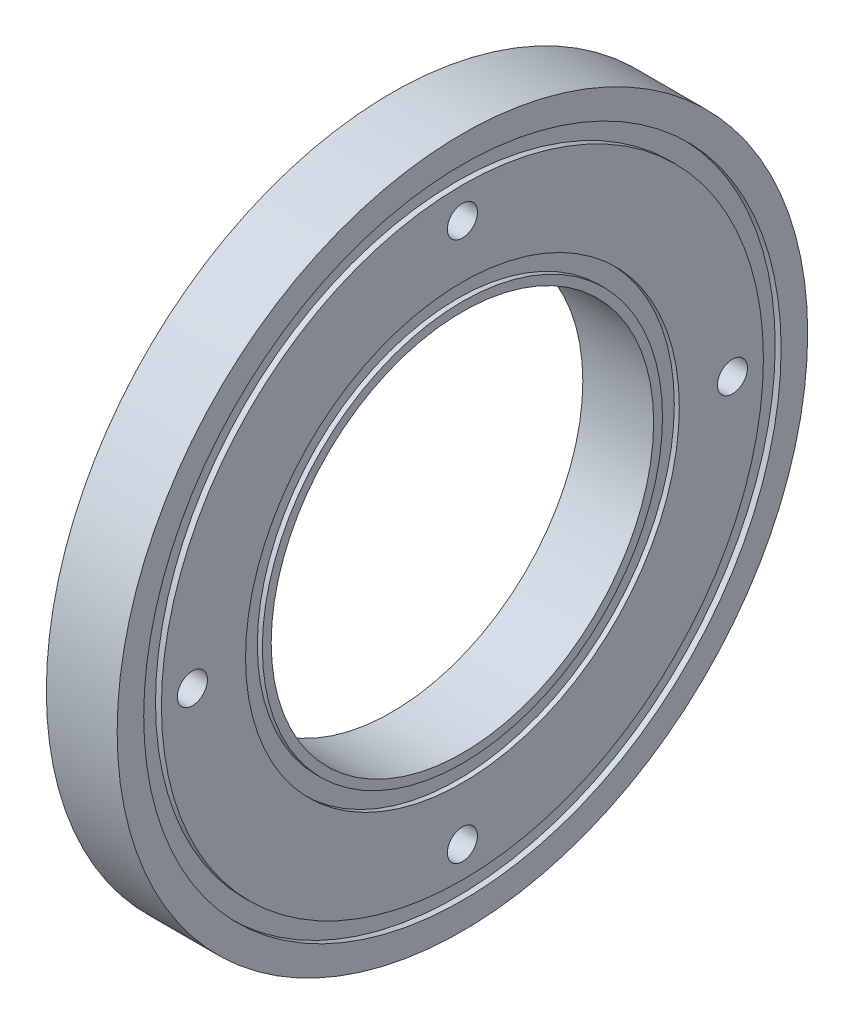
ISO-10303-21;
HEADER;
FILE_DESCRIPTION(('STEP AP214'),'2;1');
FILE_NAME('part.step','',(''),(''),'','','');
FILE_SCHEMA(('AUTOMOTIVE_DESIGN { 1 0 10303 214 1 1 1 1 }'));
ENDSEC;
DATA;
#1=APPLICATION_CONTEXT('core data for automotive mechanical design processes');
#2=APPLICATION_PROTOCOL_DEFINITION('international standard','automotive_design',2000,#1);
#3=PRODUCT_CONTEXT('',#1,'mechanical');
#4=PRODUCT('Part','Part','',(#3));
#5=PRODUCT_RELATED_PRODUCT_CATEGORY('part','',(#4));
#6=PRODUCT_DEFINITION_FORMATION('','',#4);
#7=PRODUCT_DEFINITION_CONTEXT('part definition',#1,'design');
#8=PRODUCT_DEFINITION('design','',#6,#7);
#9=PRODUCT_DEFINITION_SHAPE('','',#8);
#10=(LENGTH_UNIT() NAMED_UNIT(*) SI_UNIT(.MILLI.,.METRE.));
#11=(NAMED_UNIT(*) PLANE_ANGLE_UNIT() SI_UNIT($,.RADIAN.));
#12=(NAMED_UNIT(*) SI_UNIT($,.STERADIAN.) SOLID_ANGLE_UNIT());
#13=UNCERTAINTY_MEASURE_WITH_UNIT(LENGTH_MEASURE(1.E-05),#10,'distance_accuracy_value','');
#14=(GEOMETRIC_REPRESENTATION_CONTEXT(3) GLOBAL_UNCERTAINTY_ASSIGNED_CONTEXT((#13)) GLOBAL_UNIT_ASSIGNED_CONTEXT((#10,
#11,#12)) REPRESENTATION_CONTEXT('',''));
#15=CARTESIAN_POINT('',(0.,0.,0.));
#16=DIRECTION('',(0.,0.,1.));
#17=DIRECTION('',(1.,0.,0.));
#18=AXIS2_PLACEMENT_3D('',#15,#16,#17);
#19=CARTESIAN_POINT('',(13.7146712087275,0.,0.));
#20=DIRECTION('',(1.,0.,0.));
#21=DIRECTION('',(0.,0.,-1.));
#22=AXIS2_PLACEMENT_3D('',#19,#20,#21);
#23=PLANE('',#22);
#24=CARTESIAN_POINT('',(13.7146712087275,0.,0.));
#25=DIRECTION('',(-1.,0.,0.));
#26=DIRECTION('',(0.,0.,1.));
#27=AXIS2_PLACEMENT_3D('',#24,#25,#26);
#28=CIRCLE('',#27,34.);
#29=CARTESIAN_POINT('',(13.7146712087275,0.,34.));
#30=VERTEX_POINT('',#29);
#31=EDGE_CURVE('E10',#30,#30,#28,.T.);
#32=ORIENTED_EDGE('',*,*,#31,.F.);
#33=EDGE_LOOP('',(#32));
#34=FACE_BOUND('',#33,.T.);
#35=CARTESIAN_POINT('',(13.7146712087275,0.,0.));
#36=DIRECTION('',(-1.,0.,0.));
#37=DIRECTION('',(0.,0.,1.));
#38=AXIS2_PLACEMENT_3D('',#35,#36,#37);
#39=CIRCLE('',#38,36.);
#40=CARTESIAN_POINT('',(13.7146712087275,0.,36.));
#41=VERTEX_POINT('',#40);
#42=EDGE_CURVE('E105',#41,#41,#39,.T.);
#43=ORIENTED_EDGE('',*,*,#42,.T.);
#44=EDGE_LOOP('',(#43));
#45=FACE_BOUND('',#44,.T.);
#46=ADVANCED_FACE('F41',(#34,#45),#23,.F.);
#47=CARTESIAN_POINT('',(-801.920554309434,0.,0.));
#48=DIRECTION('',(-1.,0.,0.));
#49=DIRECTION('',(0.,0.,1.));
#50=AXIS2_PLACEMENT_3D('',#47,#48,#49);
#51=CYLINDRICAL_SURFACE('',#50,34.);
#52=CARTESIAN_POINT('',(13.0476712087275,0.,0.));
#53=DIRECTION('',(-1.,0.,0.));
#54=DIRECTION('',(0.,0.,1.));
#55=AXIS2_PLACEMENT_3D('',#52,#53,#54);
#56=CIRCLE('',#55,34.);
#57=CARTESIAN_POINT('',(13.0476712087275,0.,34.));
#58=VERTEX_POINT('',#57);
#59=EDGE_CURVE('E47',#58,#58,#56,.T.);
#60=ORIENTED_EDGE('',*,*,#59,.F.);
#61=EDGE_LOOP('',(#60));
#62=FACE_BOUND('',#61,.T.);
#63=ORIENTED_EDGE('',*,*,#31,.T.);
#64=EDGE_LOOP('',(#63));
#65=FACE_BOUND('',#64,.T.);
#66=ADVANCED_FACE('F139',(#62,#65),#51,.T.);
#67=CARTESIAN_POINT('',(13.0476712087275,0.,0.));
#68=DIRECTION('',(1.,0.,0.));
#69=DIRECTION('',(0.,0.,-1.));
#70=AXIS2_PLACEMENT_3D('',#67,#68,#69);
#71=PLANE('',#70);
#72=CARTESIAN_POINT('',(13.0476712087275,30.5,0.));
#73=DIRECTION('',(-1.,0.,0.));
#74=DIRECTION('',(0.,0.,1.));
#75=AXIS2_PLACEMENT_3D('',#72,#73,#74);
#76=CIRCLE('',#75,1.7);
#77=CARTESIAN_POINT('',(13.0476712087275,30.5,1.7));
#78=VERTEX_POINT('',#77);
#79=EDGE_CURVE('E129',#78,#78,#76,.T.);
#80=ORIENTED_EDGE('',*,*,#79,.F.);
#81=EDGE_LOOP('',(#80));
#82=FACE_BOUND('',#81,.T.);
#83=CARTESIAN_POINT('',(13.0476712087275,0.,30.5));
#84=DIRECTION('',(-1.,0.,0.));
#85=DIRECTION('',(0.,0.,1.));
#86=AXIS2_PLACEMENT_3D('',#83,#84,#85);
#87=CIRCLE('',#86,1.7);
#88=CARTESIAN_POINT('',(13.0476712087275,0.,32.2));
#89=VERTEX_POINT('',#88);
#90=EDGE_CURVE('E123',#89,#89,#87,.T.);
#91=ORIENTED_EDGE('',*,*,#90,.F.);
#92=EDGE_LOOP('',(#91));
#93=FACE_BOUND('',#92,.T.);
#94=CARTESIAN_POINT('',(13.0476712087275,0.,-30.5));
#95=DIRECTION('',(-1.,0.,0.));
#96=DIRECTION('',(0.,0.,1.));
#97=AXIS2_PLACEMENT_3D('',#94,#95,#96);
#98=CIRCLE('',#97,1.7);
#99=CARTESIAN_POINT('',(13.0476712087275,0.,-28.8));
#100=VERTEX_POINT('',#99);
#101=EDGE_CURVE('E117',#100,#100,#98,.T.);
#102=ORIENTED_EDGE('',*,*,#101,.F.);
#103=EDGE_LOOP('',(#102));
#104=FACE_BOUND('',#103,.T.);
#105=CARTESIAN_POINT('',(13.0476712087275,-30.5,0.));
#106=DIRECTION('',(-1.,0.,0.));
#107=DIRECTION('',(0.,0.,1.));
#108=AXIS2_PLACEMENT_3D('',#105,#106,#107);
#109=CIRCLE('',#108,1.7);
#110=CARTESIAN_POINT('',(13.0476712087275,-30.5,1.7));
#111=VERTEX_POINT('',#110);
#112=EDGE_CURVE('E111',#111,#111,#109,.T.);
#113=ORIENTED_EDGE('',*,*,#112,.F.);
#114=EDGE_LOOP('',(#113));
#115=FACE_BOUND('',#114,.T.);
#116=CARTESIAN_POINT('',(13.0476712087275,0.,0.));
#117=DIRECTION('',(-1.,0.,0.));
#118=DIRECTION('',(0.,0.,1.));
#119=AXIS2_PLACEMENT_3D('',#116,#117,#118);
#120=CIRCLE('',#119,24.5);
#121=CARTESIAN_POINT('',(13.0476712087275,0.,24.5));
#122=VERTEX_POINT('',#121);
#123=EDGE_CURVE('E51',#122,#122,#120,.T.);
#124=ORIENTED_EDGE('',*,*,#123,.F.);
#125=EDGE_LOOP('',(#124));
#126=FACE_BOUND('',#125,.T.);
#127=ORIENTED_EDGE('',*,*,#59,.T.);
#128=EDGE_LOOP('',(#127));
#129=FACE_BOUND('',#128,.T.);
#130=ADVANCED_FACE('F135',(#82,#93,#104,#115,#126,#129),#71,.F.);
#131=CARTESIAN_POINT('',(-801.920554309434,0.,0.));
#132=DIRECTION('',(-1.,0.,0.));
#133=DIRECTION('',(0.,0.,1.));
#134=AXIS2_PLACEMENT_3D('',#131,#132,#133);
#135=CYLINDRICAL_SURFACE('',#134,24.5);
#136=CARTESIAN_POINT('',(13.6136712087275,0.,0.));
#137=DIRECTION('',(-1.,0.,0.));
#138=DIRECTION('',(0.,0.,1.));
#139=AXIS2_PLACEMENT_3D('',#136,#137,#138);
#140=CIRCLE('',#139,24.5);
#141=CARTESIAN_POINT('',(13.6136712087275,0.,24.5));
#142=VERTEX_POINT('',#141);
#143=EDGE_CURVE('E55',#142,#142,#140,.T.);
#144=ORIENTED_EDGE('',*,*,#143,.F.);
#145=EDGE_LOOP('',(#144));
#146=FACE_BOUND('',#145,.T.);
#147=ORIENTED_EDGE('',*,*,#123,.T.);
#148=EDGE_LOOP('',(#147));
#149=FACE_BOUND('',#148,.T.);
#150=ADVANCED_FACE('F138',(#146,#149),#135,.F.);
#151=CARTESIAN_POINT('',(13.6136712087275,0.,0.));
#152=DIRECTION('',(1.,0.,0.));
#153=DIRECTION('',(0.,0.,-1.));
#154=AXIS2_PLACEMENT_3D('',#151,#152,#153);
#155=PLANE('',#154);
#156=CARTESIAN_POINT('',(13.6136712087275,0.,0.));
#157=DIRECTION('',(-1.,0.,0.));
#158=DIRECTION('',(0.,0.,1.));
#159=AXIS2_PLACEMENT_3D('',#156,#157,#158);
#160=CIRCLE('',#159,22.6);
#161=CARTESIAN_POINT('',(13.6136712087275,0.,22.6));
#162=VERTEX_POINT('',#161);
#163=EDGE_CURVE('E60',#162,#162,#160,.T.);
#164=ORIENTED_EDGE('',*,*,#163,.F.);
#165=EDGE_LOOP('',(#164));
#166=FACE_BOUND('',#165,.T.);
#167=ORIENTED_EDGE('',*,*,#143,.T.);
#168=EDGE_LOOP('',(#167));
#169=FACE_BOUND('',#168,.T.);
#170=ADVANCED_FACE('F151',(#166,#169),#155,.F.);
#171=CARTESIAN_POINT('',(-801.920554309434,0.,0.));
#172=DIRECTION('',(-1.,0.,0.));
#173=DIRECTION('',(0.,0.,1.));
#174=AXIS2_PLACEMENT_3D('',#171,#172,#173);
#175=CYLINDRICAL_SURFACE('',#174,22.6);
#176=CARTESIAN_POINT('',(13.0476712087275,0.,0.));
#177=DIRECTION('',(-1.,0.,0.));
#178=DIRECTION('',(0.,0.,1.));
#179=AXIS2_PLACEMENT_3D('',#176,#177,#178);
#180=CIRCLE('',#179,22.6);
#181=CARTESIAN_POINT('',(13.0476712087275,0.,22.6));
#182=VERTEX_POINT('',#181);
#183=EDGE_CURVE('E63',#182,#182,#180,.T.);
#184=ORIENTED_EDGE('',*,*,#183,.F.);
#185=EDGE_LOOP('',(#184));
#186=FACE_BOUND('',#185,.T.);
#187=ORIENTED_EDGE('',*,*,#163,.T.);
#188=EDGE_LOOP('',(#187));
#189=FACE_BOUND('',#188,.T.);
#190=ADVANCED_FACE('F158',(#186,#189),#175,.T.);
#191=CARTESIAN_POINT('',(13.0476712087275,0.,0.));
#192=DIRECTION('',(1.,0.,0.));
#193=DIRECTION('',(0.,0.,-1.));
#194=AXIS2_PLACEMENT_3D('',#191,#192,#193);
#195=PLANE('',#194);
#196=CARTESIAN_POINT('',(13.0476712087275,0.,0.));
#197=DIRECTION('',(-1.,0.,0.));
#198=DIRECTION('',(0.,0.,1.));
#199=AXIS2_PLACEMENT_3D('',#196,#197,#198);
#200=CIRCLE('',#199,21.6);
#201=CARTESIAN_POINT('',(13.0476712087275,0.,21.6));
#202=VERTEX_POINT('',#201);
#203=EDGE_CURVE('E66',#202,#202,#200,.T.);
#204=ORIENTED_EDGE('',*,*,#203,.F.);
#205=EDGE_LOOP('',(#204));
#206=FACE_BOUND('',#205,.T.);
#207=ORIENTED_EDGE('',*,*,#183,.T.);
#208=EDGE_LOOP('',(#207));
#209=FACE_BOUND('',#208,.T.);
#210=ADVANCED_FACE('F228',(#206,#209),#195,.F.);
#211=CARTESIAN_POINT('',(-801.920554309434,0.,0.));
#212=DIRECTION('',(-1.,0.,0.));
#213=DIRECTION('',(0.,0.,1.));
#214=AXIS2_PLACEMENT_3D('',#211,#212,#213);
#215=CYLINDRICAL_SURFACE('',#214,21.6);
#216=CARTESIAN_POINT('',(21.0476712087275,0.,0.));
#217=DIRECTION('',(-1.,0.,0.));
#218=DIRECTION('',(0.,0.,1.));
#219=AXIS2_PLACEMENT_3D('',#216,#217,#218);
#220=CIRCLE('',#219,21.6);
#221=CARTESIAN_POINT('',(21.0476712087275,0.,21.6));
#222=VERTEX_POINT('',#221);
#223=EDGE_CURVE('E69',#222,#222,#220,.T.);
#224=ORIENTED_EDGE('',*,*,#223,.F.);
#225=EDGE_LOOP('',(#224));
#226=FACE_BOUND('',#225,.T.);
#227=ORIENTED_EDGE('',*,*,#203,.T.);
#228=EDGE_LOOP('',(#227));
#229=FACE_BOUND('',#228,.T.);
#230=ADVANCED_FACE('F224',(#226,#229),#215,.F.);
#231=CARTESIAN_POINT('',(21.0476712087275,0.,0.));
#232=DIRECTION('',(1.,0.,0.));
#233=DIRECTION('',(0.,0.,-1.));
#234=AXIS2_PLACEMENT_3D('',#231,#232,#233);
#235=PLANE('',#234);
#236=ORIENTED_EDGE('',*,*,#223,.T.);
#237=EDGE_LOOP('',(#236));
#238=FACE_BOUND('',#237,.T.);
#239=CARTESIAN_POINT('',(21.0476712087275,0.,0.));
#240=DIRECTION('',(-1.,0.,0.));
#241=DIRECTION('',(0.,0.,1.));
#242=AXIS2_PLACEMENT_3D('',#239,#240,#241);
#243=CIRCLE('',#242,22.6);
#244=CARTESIAN_POINT('',(21.0476712087275,0.,22.6));
#245=VERTEX_POINT('',#244);
#246=EDGE_CURVE('E72',#245,#245,#243,.T.);
#247=ORIENTED_EDGE('',*,*,#246,.F.);
#248=EDGE_LOOP('',(#247));
#249=FACE_BOUND('',#248,.T.);
#250=ADVANCED_FACE('F220',(#238,#249),#235,.T.);
#251=CARTESIAN_POINT('',(-801.920554309434,0.,0.));
#252=DIRECTION('',(-1.,0.,0.));
#253=DIRECTION('',(0.,0.,1.));
#254=AXIS2_PLACEMENT_3D('',#251,#252,#253);
#255=CYLINDRICAL_SURFACE('',#254,22.6);
#256=ORIENTED_EDGE('',*,*,#246,.T.);
#257=EDGE_LOOP('',(#256));
#258=FACE_BOUND('',#257,.T.);
#259=CARTESIAN_POINT('',(20.4816712087276,0.,0.));
#260=DIRECTION('',(-1.,0.,0.));
#261=DIRECTION('',(0.,0.,1.));
#262=AXIS2_PLACEMENT_3D('',#259,#260,#261);
#263=CIRCLE('',#262,22.6);
#264=CARTESIAN_POINT('',(20.4816712087276,0.,22.6));
#265=VERTEX_POINT('',#264);
#266=EDGE_CURVE('E75',#265,#265,#263,.T.);
#267=ORIENTED_EDGE('',*,*,#266,.F.);
#268=EDGE_LOOP('',(#267));
#269=FACE_BOUND('',#268,.T.);
#270=ADVANCED_FACE('F216',(#258,#269),#255,.T.);
#271=CARTESIAN_POINT('',(20.4816712087275,0.,0.));
#272=DIRECTION('',(1.,0.,0.));
#273=DIRECTION('',(0.,0.,-1.));
#274=AXIS2_PLACEMENT_3D('',#271,#272,#273);
#275=PLANE('',#274);
#276=ORIENTED_EDGE('',*,*,#266,.T.);
#277=EDGE_LOOP('',(#276));
#278=FACE_BOUND('',#277,.T.);
#279=CARTESIAN_POINT('',(20.4816712087276,0.,0.));
#280=DIRECTION('',(-1.,0.,0.));
#281=DIRECTION('',(0.,0.,1.));
#282=AXIS2_PLACEMENT_3D('',#279,#280,#281);
#283=CIRCLE('',#282,24.5);
#284=CARTESIAN_POINT('',(20.4816712087276,0.,24.5));
#285=VERTEX_POINT('',#284);
#286=EDGE_CURVE('E78',#285,#285,#283,.T.);
#287=ORIENTED_EDGE('',*,*,#286,.F.);
#288=EDGE_LOOP('',(#287));
#289=FACE_BOUND('',#288,.T.);
#290=ADVANCED_FACE('F212',(#278,#289),#275,.T.);
#291=CARTESIAN_POINT('',(-801.920554309434,0.,0.));
#292=DIRECTION('',(-1.,0.,0.));
#293=DIRECTION('',(0.,0.,1.));
#294=AXIS2_PLACEMENT_3D('',#291,#292,#293);
#295=CYLINDRICAL_SURFACE('',#294,24.5);
#296=ORIENTED_EDGE('',*,*,#286,.T.);
#297=EDGE_LOOP('',(#296));
#298=FACE_BOUND('',#297,.T.);
#299=CARTESIAN_POINT('',(21.0476712087275,0.,0.));
#300=DIRECTION('',(-1.,0.,0.));
#301=DIRECTION('',(0.,0.,1.));
#302=AXIS2_PLACEMENT_3D('',#299,#300,#301);
#303=CIRCLE('',#302,24.5);
#304=CARTESIAN_POINT('',(21.0476712087275,0.,24.5));
#305=VERTEX_POINT('',#304);
#306=EDGE_CURVE('E81',#305,#305,#303,.T.);
#307=ORIENTED_EDGE('',*,*,#306,.F.);
#308=EDGE_LOOP('',(#307));
#309=FACE_BOUND('',#308,.T.);
#310=ADVANCED_FACE('F209',(#298,#309),#295,.F.);
#311=CARTESIAN_POINT('',(21.0476712087275,0.,0.));
#312=DIRECTION('',(-1.,0.,0.));
#313=DIRECTION('',(0.,0.,1.));
#314=AXIS2_PLACEMENT_3D('',#311,#312,#313);
#315=PLANE('',#314);
#316=CARTESIAN_POINT('',(21.0476712087275,30.5,0.));
#317=DIRECTION('',(-1.,0.,0.));
#318=DIRECTION('',(0.,0.,1.));
#319=AXIS2_PLACEMENT_3D('',#316,#317,#318);
#320=CIRCLE('',#319,1.7);
#321=CARTESIAN_POINT('',(21.0476712087275,30.5,1.7));
#322=VERTEX_POINT('',#321);
#323=EDGE_CURVE('E126',#322,#322,#320,.T.);
#324=ORIENTED_EDGE('',*,*,#323,.T.);
#325=EDGE_LOOP('',(#324));
#326=FACE_BOUND('',#325,.T.);
#327=CARTESIAN_POINT('',(21.0476712087275,0.,30.5));
#328=DIRECTION('',(-1.,0.,0.));
#329=DIRECTION('',(0.,0.,1.));
#330=AXIS2_PLACEMENT_3D('',#327,#328,#329);
#331=CIRCLE('',#330,1.7);
#332=CARTESIAN_POINT('',(21.0476712087275,0.,32.2));
#333=VERTEX_POINT('',#332);
#334=EDGE_CURVE('E120',#333,#333,#331,.T.);
#335=ORIENTED_EDGE('',*,*,#334,.T.);
#336=EDGE_LOOP('',(#335));
#337=FACE_BOUND('',#336,.T.);
#338=CARTESIAN_POINT('',(21.0476712087275,0.,-30.5));
#339=DIRECTION('',(-1.,0.,0.));
#340=DIRECTION('',(0.,0.,1.));
#341=AXIS2_PLACEMENT_3D('',#338,#339,#340);
#342=CIRCLE('',#341,1.7);
#343=CARTESIAN_POINT('',(21.0476712087275,0.,-28.8));
#344=VERTEX_POINT('',#343);
#345=EDGE_CURVE('E114',#344,#344,#342,.T.);
#346=ORIENTED_EDGE('',*,*,#345,.T.);
#347=EDGE_LOOP('',(#346));
#348=FACE_BOUND('',#347,.T.);
#349=CARTESIAN_POINT('',(21.0476712087275,-30.5,0.));
#350=DIRECTION('',(-1.,0.,0.));
#351=DIRECTION('',(0.,0.,1.));
#352=AXIS2_PLACEMENT_3D('',#349,#350,#351);
#353=CIRCLE('',#352,1.7);
#354=CARTESIAN_POINT('',(21.0476712087275,-30.5,1.7));
#355=VERTEX_POINT('',#354);
#356=EDGE_CURVE('E108',#355,#355,#353,.T.);
#357=ORIENTED_EDGE('',*,*,#356,.T.);
#358=EDGE_LOOP('',(#357));
#359=FACE_BOUND('',#358,.T.);
#360=CARTESIAN_POINT('',(21.0476712087275,0.,0.));
#361=DIRECTION('',(-1.,0.,0.));
#362=DIRECTION('',(0.,0.,1.));
#363=AXIS2_PLACEMENT_3D('',#360,#361,#362);
#364=CIRCLE('',#363,34.);
#365=CARTESIAN_POINT('',(21.0476712087275,0.,34.));
#366=VERTEX_POINT('',#365);
#367=EDGE_CURVE('E84',#366,#366,#364,.T.);
#368=ORIENTED_EDGE('',*,*,#367,.F.);
#369=EDGE_LOOP('',(#368));
#370=FACE_BOUND('',#369,.T.);
#371=ORIENTED_EDGE('',*,*,#306,.T.);
#372=EDGE_LOOP('',(#371));
#373=FACE_BOUND('',#372,.T.);
#374=ADVANCED_FACE('F192',(#326,#337,#348,#359,#370,#373),#315,.F.);
#375=CARTESIAN_POINT('',(-801.920554309434,0.,0.));
#376=DIRECTION('',(-1.,0.,0.));
#377=DIRECTION('',(0.,0.,1.));
#378=AXIS2_PLACEMENT_3D('',#375,#376,#377);
#379=CYLINDRICAL_SURFACE('',#378,34.);
#380=ORIENTED_EDGE('',*,*,#367,.T.);
#381=EDGE_LOOP('',(#380));
#382=FACE_BOUND('',#381,.T.);
#383=CARTESIAN_POINT('',(20.3806712087274,0.,0.));
#384=DIRECTION('',(-1.,0.,0.));
#385=DIRECTION('',(0.,0.,1.));
#386=AXIS2_PLACEMENT_3D('',#383,#384,#385);
#387=CIRCLE('',#386,34.);
#388=CARTESIAN_POINT('',(20.3806712087274,0.,34.));
#389=VERTEX_POINT('',#388);
#390=EDGE_CURVE('E87',#389,#389,#387,.T.);
#391=ORIENTED_EDGE('',*,*,#390,.F.);
#392=EDGE_LOOP('',(#391));
#393=FACE_BOUND('',#392,.T.);
#394=ADVANCED_FACE('F202',(#382,#393),#379,.T.);
#395=CARTESIAN_POINT('',(20.3806712087275,0.,0.));
#396=DIRECTION('',(1.,0.,0.));
#397=DIRECTION('',(0.,0.,-1.));
#398=AXIS2_PLACEMENT_3D('',#395,#396,#397);
#399=PLANE('',#398);
#400=ORIENTED_EDGE('',*,*,#390,.T.);
#401=EDGE_LOOP('',(#400));
#402=FACE_BOUND('',#401,.T.);
#403=CARTESIAN_POINT('',(20.3806712087274,0.,0.));
#404=DIRECTION('',(-1.,0.,0.));
#405=DIRECTION('',(0.,0.,1.));
#406=AXIS2_PLACEMENT_3D('',#403,#404,#405);
#407=CIRCLE('',#406,36.);
#408=CARTESIAN_POINT('',(20.3806712087274,0.,36.));
#409=VERTEX_POINT('',#408);
#410=EDGE_CURVE('E90',#409,#409,#407,.T.);
#411=ORIENTED_EDGE('',*,*,#410,.F.);
#412=EDGE_LOOP('',(#411));
#413=FACE_BOUND('',#412,.T.);
#414=ADVANCED_FACE('F196',(#402,#413),#399,.T.);
#415=CARTESIAN_POINT('',(-801.920554309434,0.,0.));
#416=DIRECTION('',(-1.,0.,0.));
#417=DIRECTION('',(0.,0.,1.));
#418=AXIS2_PLACEMENT_3D('',#415,#416,#417);
#419=CYLINDRICAL_SURFACE('',#418,36.);
#420=ORIENTED_EDGE('',*,*,#410,.T.);
#421=EDGE_LOOP('',(#420));
#422=FACE_BOUND('',#421,.T.);
#423=CARTESIAN_POINT('',(21.0476712087275,0.,0.));
#424=DIRECTION('',(-1.,0.,0.));
#425=DIRECTION('',(0.,0.,1.));
#426=AXIS2_PLACEMENT_3D('',#423,#424,#425);
#427=CIRCLE('',#426,36.);
#428=CARTESIAN_POINT('',(21.0476712087275,0.,36.));
#429=VERTEX_POINT('',#428);
#430=EDGE_CURVE('E93',#429,#429,#427,.T.);
#431=ORIENTED_EDGE('',*,*,#430,.F.);
#432=EDGE_LOOP('',(#431));
#433=FACE_BOUND('',#432,.T.);
#434=ADVANCED_FACE('F190',(#422,#433),#419,.F.);
#435=CARTESIAN_POINT('',(21.0476712087275,0.,0.));
#436=DIRECTION('',(-1.,0.,0.));
#437=DIRECTION('',(0.,0.,1.));
#438=AXIS2_PLACEMENT_3D('',#435,#436,#437);
#439=CIRCLE('',#438,39.);
#440=CARTESIAN_POINT('',(21.0476712087275,0.,39.));
#441=VERTEX_POINT('',#440);
#442=EDGE_CURVE('E96',#441,#441,#439,.T.);
#443=ORIENTED_EDGE('',*,*,#442,.F.);
#444=EDGE_LOOP('',(#443));
#445=FACE_BOUND('',#444,.T.);
#446=ORIENTED_EDGE('',*,*,#430,.T.);
#447=EDGE_LOOP('',(#446));
#448=FACE_BOUND('',#447,.T.);
#449=ADVANCED_FACE('F184',(#445,#448),#315,.F.);
#450=CARTESIAN_POINT('',(-801.920554309434,0.,0.));
#451=DIRECTION('',(-1.,0.,0.));
#452=DIRECTION('',(0.,0.,1.));
#453=AXIS2_PLACEMENT_3D('',#450,#451,#452);
#454=CYLINDRICAL_SURFACE('',#453,39.);
#455=CARTESIAN_POINT('',(13.0476712087275,0.,0.));
#456=DIRECTION('',(-1.,0.,0.));
#457=DIRECTION('',(0.,0.,1.));
#458=AXIS2_PLACEMENT_3D('',#455,#456,#457);
#459=CIRCLE('',#458,39.);
#460=CARTESIAN_POINT('',(13.0476712087275,0.,39.));
#461=VERTEX_POINT('',#460);
#462=EDGE_CURVE('E99',#461,#461,#459,.T.);
#463=ORIENTED_EDGE('',*,*,#462,.F.);
#464=EDGE_LOOP('',(#463));
#465=FACE_BOUND('',#464,.T.);
#466=ORIENTED_EDGE('',*,*,#442,.T.);
#467=EDGE_LOOP('',(#466));
#468=FACE_BOUND('',#467,.T.);
#469=ADVANCED_FACE('F179',(#465,#468),#454,.T.);
#470=CARTESIAN_POINT('',(13.0476712087275,0.,0.));
#471=DIRECTION('',(-1.,0.,0.));
#472=DIRECTION('',(0.,0.,1.));
#473=AXIS2_PLACEMENT_3D('',#470,#471,#472);
#474=CIRCLE('',#473,36.);
#475=CARTESIAN_POINT('',(13.0476712087275,0.,36.));
#476=VERTEX_POINT('',#475);
#477=EDGE_CURVE('E102',#476,#476,#474,.T.);
#478=ORIENTED_EDGE('',*,*,#477,.F.);
#479=EDGE_LOOP('',(#478));
#480=FACE_BOUND('',#479,.T.);
#481=ORIENTED_EDGE('',*,*,#462,.T.);
#482=EDGE_LOOP('',(#481));
#483=FACE_BOUND('',#482,.T.);
#484=ADVANCED_FACE('F141',(#480,#483),#71,.F.);
#485=CARTESIAN_POINT('',(-801.920554309434,0.,0.));
#486=DIRECTION('',(-1.,0.,0.));
#487=DIRECTION('',(0.,0.,1.));
#488=AXIS2_PLACEMENT_3D('',#485,#486,#487);
#489=CYLINDRICAL_SURFACE('',#488,36.);
#490=ORIENTED_EDGE('',*,*,#42,.F.);
#491=EDGE_LOOP('',(#490));
#492=FACE_BOUND('',#491,.T.);
#493=ORIENTED_EDGE('',*,*,#477,.T.);
#494=EDGE_LOOP('',(#493));
#495=FACE_BOUND('',#494,.T.);
#496=ADVANCED_FACE('F170',(#492,#495),#489,.F.);
#497=CARTESIAN_POINT('',(13.0476712087275,-30.5,0.));
#498=DIRECTION('',(-1.,0.,0.));
#499=DIRECTION('',(0.,0.,1.));
#500=AXIS2_PLACEMENT_3D('',#497,#498,#499);
#501=CYLINDRICAL_SURFACE('',#500,1.7);
#502=ORIENTED_EDGE('',*,*,#356,.F.);
#503=EDGE_LOOP('',(#502));
#504=FACE_BOUND('',#503,.T.);
#505=ORIENTED_EDGE('',*,*,#112,.T.);
#506=EDGE_LOOP('',(#505));
#507=FACE_BOUND('',#506,.T.);
#508=ADVANCED_FACE('F173',(#504,#507),#501,.F.);
#509=CARTESIAN_POINT('',(13.0476712087275,0.,-30.5));
#510=DIRECTION('',(-1.,0.,0.));
#511=DIRECTION('',(0.,0.,1.));
#512=AXIS2_PLACEMENT_3D('',#509,#510,#511);
#513=CYLINDRICAL_SURFACE('',#512,1.7);
#514=ORIENTED_EDGE('',*,*,#345,.F.);
#515=EDGE_LOOP('',(#514));
#516=FACE_BOUND('',#515,.T.);
#517=ORIENTED_EDGE('',*,*,#101,.T.);
#518=EDGE_LOOP('',(#517));
#519=FACE_BOUND('',#518,.T.);
#520=ADVANCED_FACE('F324',(#516,#519),#513,.F.);
#521=CARTESIAN_POINT('',(13.0476712087275,0.,30.5));
#522=DIRECTION('',(-1.,0.,0.));
#523=DIRECTION('',(0.,0.,1.));
#524=AXIS2_PLACEMENT_3D('',#521,#522,#523);
#525=CYLINDRICAL_SURFACE('',#524,1.7);
#526=ORIENTED_EDGE('',*,*,#334,.F.);
#527=EDGE_LOOP('',(#526));
#528=FACE_BOUND('',#527,.T.);
#529=ORIENTED_EDGE('',*,*,#90,.T.);
#530=EDGE_LOOP('',(#529));
#531=FACE_BOUND('',#530,.T.);
#532=ADVANCED_FACE('F335',(#528,#531),#525,.F.);
#533=CARTESIAN_POINT('',(13.0476712087275,30.5,0.));
#534=DIRECTION('',(-1.,0.,0.));
#535=DIRECTION('',(0.,0.,1.));
#536=AXIS2_PLACEMENT_3D('',#533,#534,#535);
#537=CYLINDRICAL_SURFACE('',#536,1.7);
#538=ORIENTED_EDGE('',*,*,#323,.F.);
#539=EDGE_LOOP('',(#538));
#540=FACE_BOUND('',#539,.T.);
#541=ORIENTED_EDGE('',*,*,#79,.T.);
#542=EDGE_LOOP('',(#541));
#543=FACE_BOUND('',#542,.T.);
#544=ADVANCED_FACE('F133',(#540,#543),#537,.F.);
#545=CLOSED_SHELL('',(#46,#66,#130,#150,#170,#190,#210,#230,#250,#270,#290,#310,#374,#394,#414,
#434,#449,#469,#484,#496,#508,#520,#532,#544));
#546=MANIFOLD_SOLID_BREP('B2',#545);
#547=ADVANCED_BREP_SHAPE_REPRESENTATION('',(#18,#546),#14);
#548=SHAPE_DEFINITION_REPRESENTATION(#9,#547);
ENDSEC;
END-ISO-10303-21;
